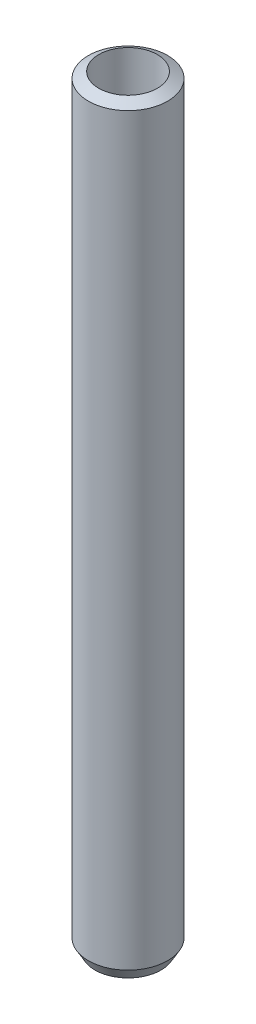
ISO-10303-21;
HEADER;
FILE_DESCRIPTION(('STEP AP214'),'2;1');
FILE_NAME('part.step','',(''),(''),'','','');
FILE_SCHEMA(('AUTOMOTIVE_DESIGN { 1 0 10303 214 1 1 1 1 }'));
ENDSEC;
DATA;
#1=APPLICATION_CONTEXT('core data for automotive mechanical design processes');
#2=APPLICATION_PROTOCOL_DEFINITION('international standard','automotive_design',2000,#1);
#3=PRODUCT_CONTEXT('',#1,'mechanical');
#4=PRODUCT('Part','Part','',(#3));
#5=PRODUCT_RELATED_PRODUCT_CATEGORY('part','',(#4));
#6=PRODUCT_DEFINITION_FORMATION('','',#4);
#7=PRODUCT_DEFINITION_CONTEXT('part definition',#1,'design');
#8=PRODUCT_DEFINITION('design','',#6,#7);
#9=PRODUCT_DEFINITION_SHAPE('','',#8);
#10=(LENGTH_UNIT() NAMED_UNIT(*) SI_UNIT(.MILLI.,.METRE.));
#11=(NAMED_UNIT(*) PLANE_ANGLE_UNIT() SI_UNIT($,.RADIAN.));
#12=(NAMED_UNIT(*) SI_UNIT($,.STERADIAN.) SOLID_ANGLE_UNIT());
#13=UNCERTAINTY_MEASURE_WITH_UNIT(LENGTH_MEASURE(1.E-05),#10,'distance_accuracy_value','');
#14=(GEOMETRIC_REPRESENTATION_CONTEXT(3) GLOBAL_UNCERTAINTY_ASSIGNED_CONTEXT((#13)) GLOBAL_UNIT_ASSIGNED_CONTEXT((#10,
#11,#12)) REPRESENTATION_CONTEXT('',''));
#15=CARTESIAN_POINT('',(0.,0.,0.));
#16=DIRECTION('',(0.,0.,1.));
#17=DIRECTION('',(1.,0.,0.));
#18=AXIS2_PLACEMENT_3D('',#15,#16,#17);
#19=CARTESIAN_POINT('',(0.,384.846403023282,0.));
#20=DIRECTION('',(0.,-1.,0.));
#21=DIRECTION('',(0.,0.,-1.));
#22=AXIS2_PLACEMENT_3D('',#19,#20,#21);
#23=CYLINDRICAL_SURFACE('',#22,20.);
#24=CARTESIAN_POINT('',(0.,381.501514397649,0.));
#25=DIRECTION('',(0.,1.,0.));
#26=DIRECTION('',(0.,0.,1.));
#27=AXIS2_PLACEMENT_3D('',#24,#25,#26);
#28=CIRCLE('',#27,20.);
#29=CARTESIAN_POINT('',(0.,381.501514397649,-20.));
#30=VERTEX_POINT('',#29);
#31=EDGE_CURVE('E50',#30,#30,#28,.F.);
#32=ORIENTED_EDGE('',*,*,#31,.T.);
#33=EDGE_LOOP('',(#32));
#34=FACE_BOUND('',#33,.T.);
#35=CARTESIAN_POINT('',(0.,5.79351704525477,0.));
#36=DIRECTION('',(0.,1.,0.));
#37=DIRECTION('',(0.,0.,1.));
#38=AXIS2_PLACEMENT_3D('',#35,#36,#37);
#39=CIRCLE('',#38,20.);
#40=CARTESIAN_POINT('',(0.,5.79351704525477,20.));
#41=VERTEX_POINT('',#40);
#42=EDGE_CURVE('E51',#41,#41,#39,.T.);
#43=ORIENTED_EDGE('',*,*,#42,.T.);
#44=EDGE_LOOP('',(#43));
#45=FACE_BOUND('',#44,.T.);
#46=ADVANCED_FACE('F39',(#34,#45),#23,.T.);
#47=CARTESIAN_POINT('',(0.,0.,0.));
#48=DIRECTION('',(0.,1.,0.));
#49=DIRECTION('',(0.,0.,1.));
#50=AXIS2_PLACEMENT_3D('',#47,#48,#49);
#51=PLANE('',#50);
#52=CARTESIAN_POINT('',(0.,0.,0.));
#53=DIRECTION('',(0.,1.,0.));
#54=DIRECTION('',(0.,0.,1.));
#55=AXIS2_PLACEMENT_3D('',#52,#53,#54);
#56=CIRCLE('',#55,16.6551113743675);
#57=CARTESIAN_POINT('',(0.,0.,16.6551113743675));
#58=VERTEX_POINT('',#57);
#59=EDGE_CURVE('E10',#58,#58,#56,.F.);
#60=ORIENTED_EDGE('',*,*,#59,.T.);
#61=EDGE_LOOP('',(#60));
#62=FACE_BOUND('',#61,.T.);
#63=CARTESIAN_POINT('',(0.,0.,0.));
#64=DIRECTION('',(0.,1.,0.));
#65=DIRECTION('',(0.,0.,1.));
#66=AXIS2_PLACEMENT_3D('',#63,#64,#65);
#67=CIRCLE('',#66,14.7746224988087);
#68=CARTESIAN_POINT('',(0.,0.,14.7746224988087));
#69=VERTEX_POINT('',#68);
#70=EDGE_CURVE('E58',#69,#69,#67,.T.);
#71=ORIENTED_EDGE('',*,*,#70,.T.);
#72=EDGE_LOOP('',(#71));
#73=FACE_BOUND('',#72,.T.);
#74=ADVANCED_FACE('F62',(#62,#73),#51,.F.);
#75=CARTESIAN_POINT('',(0.,384.846403023282,0.));
#76=DIRECTION('',(0.,-1.,0.));
#77=DIRECTION('',(0.,0.,-1.));
#78=AXIS2_PLACEMENT_3D('',#75,#76,#77);
#79=CYLINDRICAL_SURFACE('',#78,14.7746224988087);
#80=CARTESIAN_POINT('',(0.,384.51838750458,0.));
#81=DIRECTION('',(0.,-1.,0.));
#82=DIRECTION('',(0.,0.,-1.));
#83=AXIS2_PLACEMENT_3D('',#80,#81,#82);
#84=CIRCLE('',#83,14.7746224988087);
#85=CARTESIAN_POINT('',(0.,384.51838750458,-14.7746224988087));
#86=VERTEX_POINT('',#85);
#87=EDGE_CURVE('E54',#86,#86,#84,.F.);
#88=ORIENTED_EDGE('',*,*,#87,.T.);
#89=EDGE_LOOP('',(#88));
#90=FACE_BOUND('',#89,.T.);
#91=ORIENTED_EDGE('',*,*,#70,.F.);
#92=EDGE_LOOP('',(#91));
#93=FACE_BOUND('',#92,.T.);
#94=ADVANCED_FACE('F68',(#90,#93),#79,.F.);
#95=CARTESIAN_POINT('',(0.,384.846403023282,0.));
#96=DIRECTION('',(0.,-1.,0.));
#97=DIRECTION('',(0.,0.,-1.));
#98=AXIS2_PLACEMENT_3D('',#95,#96,#97);
#99=CONICAL_SURFACE('',#98,14.2064829547452,1.0471975511966);
#100=CARTESIAN_POINT('',(0.,381.501514397649,-20.));
#101=CARTESIAN_POINT('',(0.,381.53294015918,-19.9455689843626));
#102=CARTESIAN_POINT('',(0.,381.564365920711,-19.8911379687252));
#103=CARTESIAN_POINT('',(0.,381.627217443772,-19.7822759374504));
#104=CARTESIAN_POINT('',(0.,381.658643205302,-19.727844921813));
#105=CARTESIAN_POINT('',(0.,381.721494728363,-19.6189828905382));
#106=CARTESIAN_POINT('',(0.,381.752920489894,-19.5645518749008));
#107=CARTESIAN_POINT('',(0.,381.815772012955,-19.4556898436259));
#108=CARTESIAN_POINT('',(0.,381.847197774485,-19.4012588279885));
#109=CARTESIAN_POINT('',(0.,381.910049297546,-19.2923967967137));
#110=CARTESIAN_POINT('',(0.,381.941475059077,-19.2379657810763));
#111=CARTESIAN_POINT('',(0.,382.004326582138,-19.1291037498015));
#112=CARTESIAN_POINT('',(0.,382.035752343668,-19.0746727341641));
#113=CARTESIAN_POINT('',(0.,382.098603866729,-18.9658107028893));
#114=CARTESIAN_POINT('',(0.,382.13002962826,-18.9113796872518));
#115=CARTESIAN_POINT('',(0.,382.192881151321,-18.802517655977));
#116=CARTESIAN_POINT('',(0.,382.224306912852,-18.7480866403396));
#117=CARTESIAN_POINT('',(0.,382.287158435913,-18.6392246090648));
#118=CARTESIAN_POINT('',(0.,382.318584197443,-18.5847935934274));
#119=CARTESIAN_POINT('',(0.,382.381435720504,-18.4759315621525));
#120=CARTESIAN_POINT('',(0.,382.412861482035,-18.4215005465151));
#121=CARTESIAN_POINT('',(0.,382.475713005096,-18.3126385152403));
#122=CARTESIAN_POINT('',(0.,382.507138766626,-18.2582074996029));
#123=CARTESIAN_POINT('',(0.,382.569990289687,-18.1493454683281));
#124=CARTESIAN_POINT('',(0.,382.601416051218,-18.0949144526907));
#125=CARTESIAN_POINT('',(0.,382.664267574279,-17.9860524214159));
#126=CARTESIAN_POINT('',(0.,382.695693335809,-17.9316214057785));
#127=CARTESIAN_POINT('',(0.,382.75854485887,-17.8227593745036));
#128=CARTESIAN_POINT('',(0.,382.789970620401,-17.7683283588662));
#129=CARTESIAN_POINT('',(0.,382.852822143462,-17.6594663275914));
#130=CARTESIAN_POINT('',(0.,382.884247904993,-17.605035311954));
#131=CARTESIAN_POINT('',(0.,382.947099428054,-17.4961732806792));
#132=CARTESIAN_POINT('',(0.,382.978525189584,-17.4417422650418));
#133=CARTESIAN_POINT('',(0.,383.041376712645,-17.3328802337669));
#134=CARTESIAN_POINT('',(0.,383.072802474176,-17.2784492181295));
#135=CARTESIAN_POINT('',(0.,383.135653997237,-17.1695871868547));
#136=CARTESIAN_POINT('',(0.,383.167079758767,-17.1151561712173));
#137=CARTESIAN_POINT('',(0.,383.229931281828,-17.0062941399425));
#138=CARTESIAN_POINT('',(0.,383.261357043359,-16.9518631243051));
#139=CARTESIAN_POINT('',(0.,383.32420856642,-16.8430010930302));
#140=CARTESIAN_POINT('',(0.,383.35563432795,-16.7885700773928));
#141=CARTESIAN_POINT('',(0.,383.418485851011,-16.679708046118));
#142=CARTESIAN_POINT('',(0.,383.449911612542,-16.6252770304806));
#143=CARTESIAN_POINT('',(0.,383.512763135603,-16.5164149992058));
#144=CARTESIAN_POINT('',(0.,383.544188897133,-16.4619839835684));
#145=CARTESIAN_POINT('',(0.,383.607040420195,-16.3531219522936));
#146=CARTESIAN_POINT('',(0.,383.638466181725,-16.2986909366561));
#147=CARTESIAN_POINT('',(0.,383.701317704786,-16.1898289053813));
#148=CARTESIAN_POINT('',(0.,383.732743466317,-16.1353978897439));
#149=CARTESIAN_POINT('',(0.,383.795594989378,-16.0265358584691));
#150=CARTESIAN_POINT('',(0.,383.827020750908,-15.9721048428317));
#151=CARTESIAN_POINT('',(0.,383.889872273969,-15.8632428115569));
#152=CARTESIAN_POINT('',(0.,383.9212980355,-15.8088117959195));
#153=CARTESIAN_POINT('',(0.,383.984149558561,-15.6999497646446));
#154=CARTESIAN_POINT('',(0.,384.015575320091,-15.6455187490072));
#155=CARTESIAN_POINT('',(0.,384.078426843152,-15.5366567177324));
#156=CARTESIAN_POINT('',(0.,384.109852604683,-15.482225702095));
#157=CARTESIAN_POINT('',(0.,384.172704127744,-15.3733636708202));
#158=CARTESIAN_POINT('',(0.,384.204129889274,-15.3189326551828));
#159=CARTESIAN_POINT('',(0.,384.266981412336,-15.2100706239079));
#160=CARTESIAN_POINT('',(0.,384.298407173866,-15.1556396082705));
#161=CARTESIAN_POINT('',(0.,384.361258696927,-15.0467775769957));
#162=CARTESIAN_POINT('',(0.,384.392684458458,-14.9923465613583));
#163=CARTESIAN_POINT('',(0.,384.455535981519,-14.8834845300835));
#164=CARTESIAN_POINT('',(0.,384.486961743049,-14.829053514446));
#165=CARTESIAN_POINT('',(0.,384.51838750458,-14.7746224988087));
#166=B_SPLINE_CURVE_WITH_KNOTS('',3,(#100,#101,#102,#103,#104,#105,#106,#107,#108,#109,#110,
#111,#112,#113,#114,#115,#116,#117,#118,#119,#120,#121,#122,#123,#124,#125,#126,#127,#128,#129,
#130,#131,#132,#133,#134,#135,#136,#137,#138,#139,#140,#141,#142,#143,#144,#145,#146,#147,#148,
#149,#150,#151,#152,#153,#154,#155,#156,#157,#158,#159,#160,#161,#162,#163,#164,#165),
.UNSPECIFIED.,.F.,.F.,(4,2,2,2,2,2,2,2,2,2,2,2,2,2,2,2,2,2,2,2,2,2,2,2,2,2,2,2,2,2,2,2,4),(0.,
0.188554569183132,0.377109138366261,0.565663707549421,0.75421827673255,0.94277284591571,
1.13132741509884,1.31988198428197,1.50843655346513,1.69699112264826,1.88554569183142,
2.07410026101455,2.26265483019768,2.45120939938084,2.63976396856397,2.82831853774713,
3.01687310693026,3.20542767611339,3.39398224529654,3.58253681447968,3.77109138366283,
3.95964595284597,4.14820052202909,4.33675509121225,4.52530966039538,4.71386422957854,
4.90241879876167,5.0909733679448,5.27952793712796,5.46808250631109,5.65663707549425,
5.84519164467738,6.03374621386054),.UNSPECIFIED.);
#167=EDGE_CURVE('BSEAM66',#30,#86,#166,.T.);
#168=ORIENTED_EDGE('',*,*,#31,.F.);
#169=ORIENTED_EDGE('',*,*,#87,.F.);
#170=ORIENTED_EDGE('',*,*,#167,.T.);
#171=ORIENTED_EDGE('',*,*,#167,.F.);
#172=EDGE_LOOP('',(#168,#170,#169,#171));
#173=FACE_BOUND('',#172,.T.);
#174=ADVANCED_FACE('F66',(#173),#99,.T.);
#175=CARTESIAN_POINT('',(0.,5.79351704525477,0.));
#176=DIRECTION('',(0.,1.,0.));
#177=DIRECTION('',(0.,0.,1.));
#178=AXIS2_PLACEMENT_3D('',#175,#176,#177);
#179=CONICAL_SURFACE('',#178,20.,0.523598775598301);
#180=ORIENTED_EDGE('',*,*,#59,.F.);
#181=EDGE_LOOP('',(#180));
#182=FACE_BOUND('',#181,.T.);
#183=ORIENTED_EDGE('',*,*,#42,.F.);
#184=EDGE_LOOP('',(#183));
#185=FACE_BOUND('',#184,.T.);
#186=ADVANCED_FACE('F45',(#182,#185),#179,.T.);
#187=CLOSED_SHELL('',(#46,#74,#94,#174,#186));
#188=MANIFOLD_SOLID_BREP('B2',#187);
#189=ADVANCED_BREP_SHAPE_REPRESENTATION('',(#18,#188),#14);
#190=SHAPE_DEFINITION_REPRESENTATION(#9,#189);
ENDSEC;
END-ISO-10303-21;
